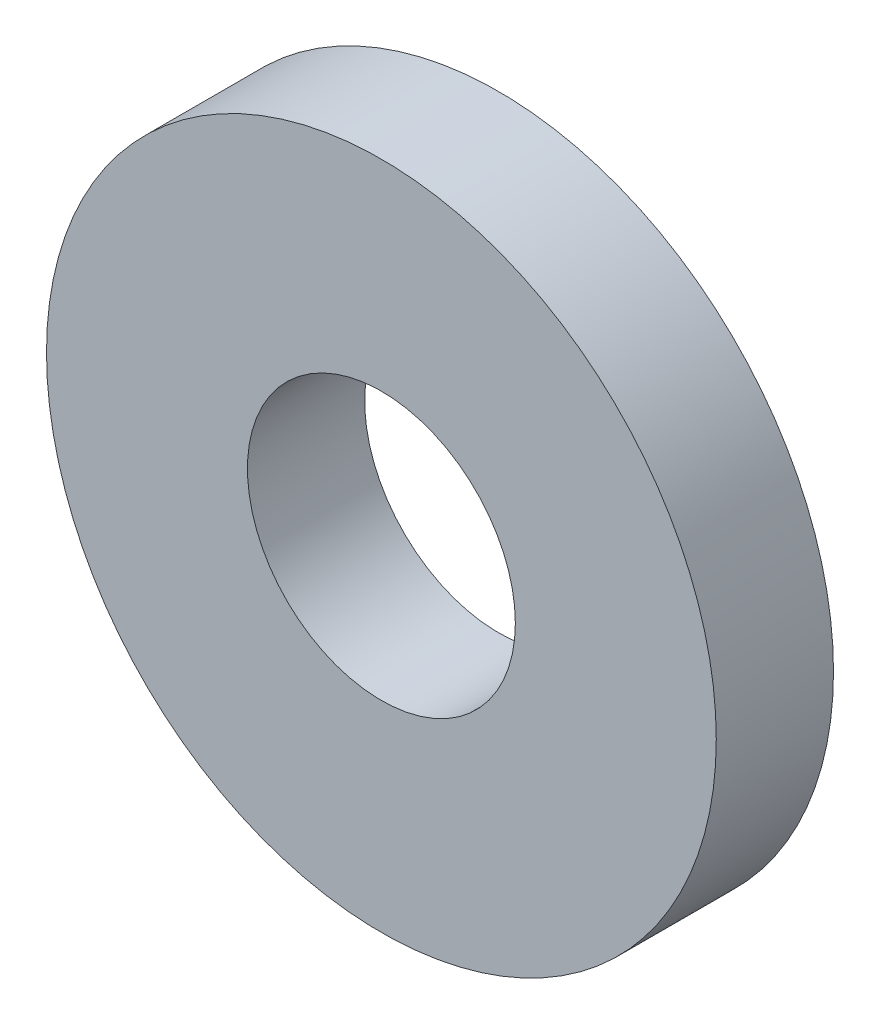
ISO-10303-21;
HEADER;
FILE_DESCRIPTION(('STEP AP214'),'2;1');
FILE_NAME('part.step','',(''),(''),'','','');
FILE_SCHEMA(('AUTOMOTIVE_DESIGN { 1 0 10303 214 1 1 1 1 }'));
ENDSEC;
DATA;
#1=APPLICATION_CONTEXT('core data for automotive mechanical design processes');
#2=APPLICATION_PROTOCOL_DEFINITION('international standard','automotive_design',2000,#1);
#3=PRODUCT_CONTEXT('',#1,'mechanical');
#4=PRODUCT('Part','Part','',(#3));
#5=PRODUCT_RELATED_PRODUCT_CATEGORY('part','',(#4));
#6=PRODUCT_DEFINITION_FORMATION('','',#4);
#7=PRODUCT_DEFINITION_CONTEXT('part definition',#1,'design');
#8=PRODUCT_DEFINITION('design','',#6,#7);
#9=PRODUCT_DEFINITION_SHAPE('','',#8);
#10=(LENGTH_UNIT() NAMED_UNIT(*) SI_UNIT(.MILLI.,.METRE.));
#11=(NAMED_UNIT(*) PLANE_ANGLE_UNIT() SI_UNIT($,.RADIAN.));
#12=(NAMED_UNIT(*) SI_UNIT($,.STERADIAN.) SOLID_ANGLE_UNIT());
#13=UNCERTAINTY_MEASURE_WITH_UNIT(LENGTH_MEASURE(1.E-05),#10,'distance_accuracy_value','');
#14=(GEOMETRIC_REPRESENTATION_CONTEXT(3) GLOBAL_UNCERTAINTY_ASSIGNED_CONTEXT((#13)) GLOBAL_UNIT_ASSIGNED_CONTEXT((#10,
#11,#12)) REPRESENTATION_CONTEXT('',''));
#15=CARTESIAN_POINT('',(0.,0.,0.));
#16=DIRECTION('',(0.,0.,1.));
#17=DIRECTION('',(1.,0.,0.));
#18=AXIS2_PLACEMENT_3D('',#15,#16,#17);
#19=CARTESIAN_POINT('',(0.,0.,1.4));
#20=DIRECTION('',(0.,0.,1.));
#21=DIRECTION('',(1.,0.,0.));
#22=AXIS2_PLACEMENT_3D('',#19,#20,#21);
#23=PLANE('',#22);
#24=CARTESIAN_POINT('',(0.,0.,1.4));
#25=DIRECTION('',(0.,0.,1.));
#26=DIRECTION('',(1.,0.,0.));
#27=AXIS2_PLACEMENT_3D('',#24,#25,#26);
#28=CIRCLE('',#27,4.);
#29=CARTESIAN_POINT('',(4.,0.,1.4));
#30=VERTEX_POINT('',#29);
#31=EDGE_CURVE('E10',#30,#30,#28,.T.);
#32=ORIENTED_EDGE('',*,*,#31,.T.);
#33=EDGE_LOOP('',(#32));
#34=FACE_BOUND('',#33,.T.);
#35=CARTESIAN_POINT('',(0.,0.,1.4));
#36=DIRECTION('',(0.,0.,1.));
#37=DIRECTION('',(1.,0.,0.));
#38=AXIS2_PLACEMENT_3D('',#35,#36,#37);
#39=CIRCLE('',#38,1.6);
#40=CARTESIAN_POINT('',(1.6,0.,1.4));
#41=VERTEX_POINT('',#40);
#42=EDGE_CURVE('E42',#41,#41,#39,.T.);
#43=ORIENTED_EDGE('',*,*,#42,.F.);
#44=EDGE_LOOP('',(#43));
#45=FACE_BOUND('',#44,.T.);
#46=ADVANCED_FACE('F31',(#34,#45),#23,.T.);
#47=CARTESIAN_POINT('',(0.,0.,0.));
#48=DIRECTION('',(0.,0.,1.));
#49=DIRECTION('',(1.,0.,0.));
#50=AXIS2_PLACEMENT_3D('',#47,#48,#49);
#51=PLANE('',#50);
#52=CARTESIAN_POINT('',(0.,0.,0.));
#53=DIRECTION('',(0.,0.,1.));
#54=DIRECTION('',(1.,0.,0.));
#55=AXIS2_PLACEMENT_3D('',#52,#53,#54);
#56=CIRCLE('',#55,4.);
#57=CARTESIAN_POINT('',(4.,0.,0.));
#58=VERTEX_POINT('',#57);
#59=EDGE_CURVE('E35',#58,#58,#56,.T.);
#60=ORIENTED_EDGE('',*,*,#59,.F.);
#61=EDGE_LOOP('',(#60));
#62=FACE_BOUND('',#61,.T.);
#63=CARTESIAN_POINT('',(0.,0.,0.));
#64=DIRECTION('',(0.,0.,1.));
#65=DIRECTION('',(1.,0.,0.));
#66=AXIS2_PLACEMENT_3D('',#63,#64,#65);
#67=CIRCLE('',#66,1.6);
#68=CARTESIAN_POINT('',(1.6,0.,0.));
#69=VERTEX_POINT('',#68);
#70=EDGE_CURVE('E44',#69,#69,#67,.T.);
#71=ORIENTED_EDGE('',*,*,#70,.T.);
#72=EDGE_LOOP('',(#71));
#73=FACE_BOUND('',#72,.T.);
#74=ADVANCED_FACE('F54',(#62,#73),#51,.F.);
#75=CARTESIAN_POINT('',(0.,0.,1.4));
#76=DIRECTION('',(0.,0.,-1.));
#77=DIRECTION('',(-1.,0.,0.));
#78=AXIS2_PLACEMENT_3D('',#75,#76,#77);
#79=CYLINDRICAL_SURFACE('',#78,4.);
#80=ORIENTED_EDGE('',*,*,#31,.F.);
#81=EDGE_LOOP('',(#80));
#82=FACE_BOUND('',#81,.T.);
#83=ORIENTED_EDGE('',*,*,#59,.T.);
#84=EDGE_LOOP('',(#83));
#85=FACE_BOUND('',#84,.T.);
#86=ADVANCED_FACE('F33',(#82,#85),#79,.T.);
#87=CARTESIAN_POINT('',(0.,0.,1.4));
#88=DIRECTION('',(0.,0.,-1.));
#89=DIRECTION('',(-1.,0.,0.));
#90=AXIS2_PLACEMENT_3D('',#87,#88,#89);
#91=CYLINDRICAL_SURFACE('',#90,1.6);
#92=ORIENTED_EDGE('',*,*,#42,.T.);
#93=EDGE_LOOP('',(#92));
#94=FACE_BOUND('',#93,.T.);
#95=ORIENTED_EDGE('',*,*,#70,.F.);
#96=EDGE_LOOP('',(#95));
#97=FACE_BOUND('',#96,.T.);
#98=ADVANCED_FACE('F50',(#94,#97),#91,.F.);
#99=CLOSED_SHELL('',(#46,#74,#86,#98));
#100=MANIFOLD_SOLID_BREP('B2',#99);
#101=ADVANCED_BREP_SHAPE_REPRESENTATION('',(#18,#100),#14);
#102=SHAPE_DEFINITION_REPRESENTATION(#9,#101);
ENDSEC;
END-ISO-10303-21;
